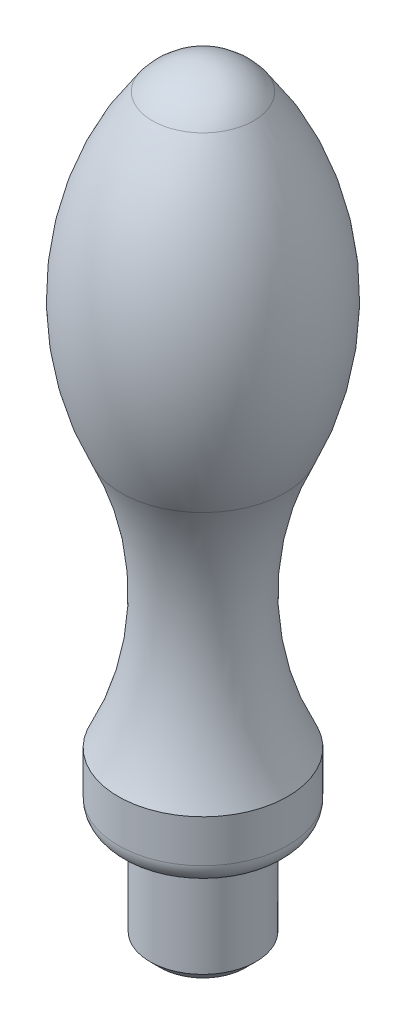
ISO-10303-21;
HEADER;
FILE_DESCRIPTION(('STEP AP214'),'2;1');
FILE_NAME('part.step','',(''),(''),'','','');
FILE_SCHEMA(('AUTOMOTIVE_DESIGN { 1 0 10303 214 1 1 1 1 }'));
ENDSEC;
DATA;
#1=APPLICATION_CONTEXT('core data for automotive mechanical design processes');
#2=APPLICATION_PROTOCOL_DEFINITION('international standard','automotive_design',2000,#1);
#3=PRODUCT_CONTEXT('',#1,'mechanical');
#4=PRODUCT('Part','Part','',(#3));
#5=PRODUCT_RELATED_PRODUCT_CATEGORY('part','',(#4));
#6=PRODUCT_DEFINITION_FORMATION('','',#4);
#7=PRODUCT_DEFINITION_CONTEXT('part definition',#1,'design');
#8=PRODUCT_DEFINITION('design','',#6,#7);
#9=PRODUCT_DEFINITION_SHAPE('','',#8);
#10=(LENGTH_UNIT() NAMED_UNIT(*) SI_UNIT(.MILLI.,.METRE.));
#11=(NAMED_UNIT(*) PLANE_ANGLE_UNIT() SI_UNIT($,.RADIAN.));
#12=(NAMED_UNIT(*) SI_UNIT($,.STERADIAN.) SOLID_ANGLE_UNIT());
#13=UNCERTAINTY_MEASURE_WITH_UNIT(LENGTH_MEASURE(1.E-05),#10,'distance_accuracy_value','');
#14=(GEOMETRIC_REPRESENTATION_CONTEXT(3) GLOBAL_UNCERTAINTY_ASSIGNED_CONTEXT((#13)) GLOBAL_UNIT_ASSIGNED_CONTEXT((#10,
#11,#12)) REPRESENTATION_CONTEXT('',''));
#15=CARTESIAN_POINT('',(0.,0.,0.));
#16=DIRECTION('',(0.,0.,1.));
#17=DIRECTION('',(1.,0.,0.));
#18=AXIS2_PLACEMENT_3D('',#15,#16,#17);
#19=CARTESIAN_POINT('',(0.,0.,0.));
#20=DIRECTION('',(0.,-1.,0.));
#21=DIRECTION('',(0.,0.,-1.));
#22=AXIS2_PLACEMENT_3D('',#19,#20,#21);
#23=PLANE('',#22);
#24=CARTESIAN_POINT('',(0.,0.,0.));
#25=DIRECTION('',(0.,-1.,0.));
#26=DIRECTION('',(0.,0.,-1.));
#27=AXIS2_PLACEMENT_3D('',#24,#25,#26);
#28=CIRCLE('',#27,4.);
#29=CARTESIAN_POINT('',(0.,0.,-4.));
#30=VERTEX_POINT('',#29);
#31=EDGE_CURVE('E10',#30,#30,#28,.T.);
#32=ORIENTED_EDGE('',*,*,#31,.T.);
#33=EDGE_LOOP('',(#32));
#34=FACE_BOUND('',#33,.T.);
#35=ADVANCED_FACE('F35',(#34),#23,.T.);
#36=CARTESIAN_POINT('',(0.,0.,0.));
#37=DIRECTION('',(0.,1.,0.));
#38=DIRECTION('',(0.,0.,1.));
#39=AXIS2_PLACEMENT_3D('',#36,#37,#38);
#40=CONICAL_SURFACE('',#39,4.,0.785398163397448);
#41=CARTESIAN_POINT('',(0.,1.,0.));
#42=DIRECTION('',(0.,-1.,0.));
#43=DIRECTION('',(0.,0.,-1.));
#44=AXIS2_PLACEMENT_3D('',#41,#42,#43);
#45=CIRCLE('',#44,5.);
#46=CARTESIAN_POINT('',(0.,1.,-5.));
#47=VERTEX_POINT('',#46);
#48=EDGE_CURVE('E41',#47,#47,#45,.T.);
#49=ORIENTED_EDGE('',*,*,#48,.T.);
#50=EDGE_LOOP('',(#49));
#51=FACE_BOUND('',#50,.T.);
#52=ORIENTED_EDGE('',*,*,#31,.F.);
#53=EDGE_LOOP('',(#52));
#54=FACE_BOUND('',#53,.T.);
#55=ADVANCED_FACE('F79',(#51,#54),#40,.T.);
#56=CARTESIAN_POINT('',(0.,-4.53690665467858,0.));
#57=DIRECTION('',(0.,-1.,0.));
#58=DIRECTION('',(0.,0.,-1.));
#59=AXIS2_PLACEMENT_3D('',#56,#57,#58);
#60=CYLINDRICAL_SURFACE('',#59,5.);
#61=CARTESIAN_POINT('',(0.,10.,0.));
#62=DIRECTION('',(0.,-1.,0.));
#63=DIRECTION('',(0.,0.,-1.));
#64=AXIS2_PLACEMENT_3D('',#61,#62,#63);
#65=CIRCLE('',#64,5.);
#66=CARTESIAN_POINT('',(0.,10.,-5.));
#67=VERTEX_POINT('',#66);
#68=EDGE_CURVE('E45',#67,#67,#65,.T.);
#69=ORIENTED_EDGE('',*,*,#68,.T.);
#70=EDGE_LOOP('',(#69));
#71=FACE_BOUND('',#70,.T.);
#72=ORIENTED_EDGE('',*,*,#48,.F.);
#73=EDGE_LOOP('',(#72));
#74=FACE_BOUND('',#73,.T.);
#75=ADVANCED_FACE('F83',(#71,#74),#60,.T.);
#76=CARTESIAN_POINT('',(5.,10.,0.));
#77=DIRECTION('',(0.,-1.,0.));
#78=DIRECTION('',(0.,0.,-1.));
#79=AXIS2_PLACEMENT_3D('',#76,#77,#78);
#80=PLANE('',#79);
#81=CARTESIAN_POINT('',(0.,10.,0.));
#82=DIRECTION('',(0.,-1.,0.));
#83=DIRECTION('',(0.,0.,-1.));
#84=AXIS2_PLACEMENT_3D('',#81,#82,#83);
#85=CIRCLE('',#84,5.99999999999998);
#86=CARTESIAN_POINT('',(0.,10.,-5.99999999999998));
#87=VERTEX_POINT('',#86);
#88=EDGE_CURVE('E49',#87,#87,#85,.T.);
#89=ORIENTED_EDGE('',*,*,#88,.T.);
#90=EDGE_LOOP('',(#89));
#91=FACE_BOUND('',#90,.T.);
#92=ORIENTED_EDGE('',*,*,#68,.F.);
#93=EDGE_LOOP('',(#92));
#94=FACE_BOUND('',#93,.T.);
#95=ADVANCED_FACE('F87',(#91,#94),#80,.T.);
#96=CARTESIAN_POINT('',(0.,12.,0.));
#97=DIRECTION('',(0.,-1.,0.));
#98=DIRECTION('',(0.,0.,-1.));
#99=AXIS2_PLACEMENT_3D('',#96,#97,#98);
#100=TOROIDAL_SURFACE('',#99,6.,2.);
#101=CARTESIAN_POINT('',(0.,12.,0.));
#102=DIRECTION('',(0.,-1.,0.));
#103=DIRECTION('',(0.,0.,-1.));
#104=AXIS2_PLACEMENT_3D('',#101,#102,#103);
#105=CIRCLE('',#104,8.);
#106=CARTESIAN_POINT('',(0.,12.,-8.));
#107=VERTEX_POINT('',#106);
#108=EDGE_CURVE('E54',#107,#107,#105,.T.);
#109=ORIENTED_EDGE('',*,*,#108,.T.);
#110=EDGE_LOOP('',(#109));
#111=FACE_BOUND('',#110,.T.);
#112=ORIENTED_EDGE('',*,*,#88,.F.);
#113=EDGE_LOOP('',(#112));
#114=FACE_BOUND('',#113,.T.);
#115=ADVANCED_FACE('F94',(#111,#114),#100,.T.);
#116=CARTESIAN_POINT('',(0.,-4.53690665467858,0.));
#117=DIRECTION('',(0.,-1.,0.));
#118=DIRECTION('',(0.,0.,-1.));
#119=AXIS2_PLACEMENT_3D('',#116,#117,#118);
#120=CYLINDRICAL_SURFACE('',#119,8.);
#121=CARTESIAN_POINT('',(0.,16.,0.));
#122=DIRECTION('',(0.,-1.,0.));
#123=DIRECTION('',(0.,0.,-1.));
#124=AXIS2_PLACEMENT_3D('',#121,#122,#123);
#125=CIRCLE('',#124,8.);
#126=CARTESIAN_POINT('',(0.,16.,-8.));
#127=VERTEX_POINT('',#126);
#128=EDGE_CURVE('E57',#127,#127,#125,.T.);
#129=ORIENTED_EDGE('',*,*,#128,.T.);
#130=EDGE_LOOP('',(#129));
#131=FACE_BOUND('',#130,.T.);
#132=ORIENTED_EDGE('',*,*,#108,.F.);
#133=EDGE_LOOP('',(#132));
#134=FACE_BOUND('',#133,.T.);
#135=ADVANCED_FACE('F98',(#131,#134),#120,.T.);
#136=CARTESIAN_POINT('',(0.,28.612918956564,0.));
#137=DIRECTION('',(0.,-1.,0.));
#138=DIRECTION('',(0.,0.,-1.));
#139=AXIS2_PLACEMENT_3D('',#136,#137,#138);
#140=TOROIDAL_SURFACE('',#139,32.9982854491093,28.);
#141=CARTESIAN_POINT('',(0.,40.6695028234232,0.));
#142=DIRECTION('',(0.,-1.,0.));
#143=DIRECTION('',(0.,0.,-1.));
#144=AXIS2_PLACEMENT_3D('',#141,#142,#143);
#145=CIRCLE('',#144,7.72698185270982);
#146=CARTESIAN_POINT('',(0.,40.6695028234232,-7.72698185270982));
#147=VERTEX_POINT('',#146);
#148=EDGE_CURVE('E60',#147,#147,#145,.T.);
#149=ORIENTED_EDGE('',*,*,#148,.T.);
#150=EDGE_LOOP('',(#149));
#151=FACE_BOUND('',#150,.T.);
#152=ORIENTED_EDGE('',*,*,#128,.F.);
#153=EDGE_LOOP('',(#152));
#154=FACE_BOUND('',#153,.T.);
#155=ADVANCED_FACE('F76',(#151,#154),#140,.F.);
#156=CARTESIAN_POINT('',(0.,52.7260866902823,0.));
#157=DIRECTION('',(0.,-1.,0.));
#158=DIRECTION('',(0.,0.,-1.));
#159=AXIS2_PLACEMENT_3D('',#156,#157,#158);
#160=DEGENERATE_TOROIDAL_SURFACE('',#159,17.5443217436896,28.,.F.);
#161=CARTESIAN_POINT('',(0.,69.6201581753775,0.));
#162=DIRECTION('',(0.,-1.,0.));
#163=DIRECTION('',(0.,0.,-1.));
#164=AXIS2_PLACEMENT_3D('',#161,#162,#163);
#165=CIRCLE('',#164,4.78481502100628);
#166=CARTESIAN_POINT('',(0.,69.6201581753775,-4.78481502100628));
#167=VERTEX_POINT('',#166);
#168=EDGE_CURVE('E63',#167,#167,#165,.T.);
#169=ORIENTED_EDGE('',*,*,#168,.T.);
#170=EDGE_LOOP('',(#169));
#171=FACE_BOUND('',#170,.T.);
#172=ORIENTED_EDGE('',*,*,#148,.F.);
#173=EDGE_LOOP('',(#172));
#174=FACE_BOUND('',#173,.T.);
#175=ADVANCED_FACE('F67',(#171,#174),#160,.F.);
#176=CARTESIAN_POINT('',(0.,66.,0.));
#177=DIRECTION('',(0.,-1.,0.));
#178=DIRECTION('',(1.,0.,0.));
#179=AXIS2_PLACEMENT_3D('',#176,#177,#178);
#180=SPHERICAL_SURFACE('',#179,6.00000000000001);
#181=ORIENTED_EDGE('',*,*,#168,.F.);
#182=EDGE_LOOP('',(#181));
#183=FACE_BOUND('',#182,.T.);
#184=ADVANCED_FACE('F70',(#183),#180,.T.);
#185=CLOSED_SHELL('',(#35,#55,#75,#95,#115,#135,#155,#175,#184));
#186=MANIFOLD_SOLID_BREP('B2',#185);
#187=ADVANCED_BREP_SHAPE_REPRESENTATION('',(#18,#186),#14);
#188=SHAPE_DEFINITION_REPRESENTATION(#9,#187);
ENDSEC;
END-ISO-10303-21;
